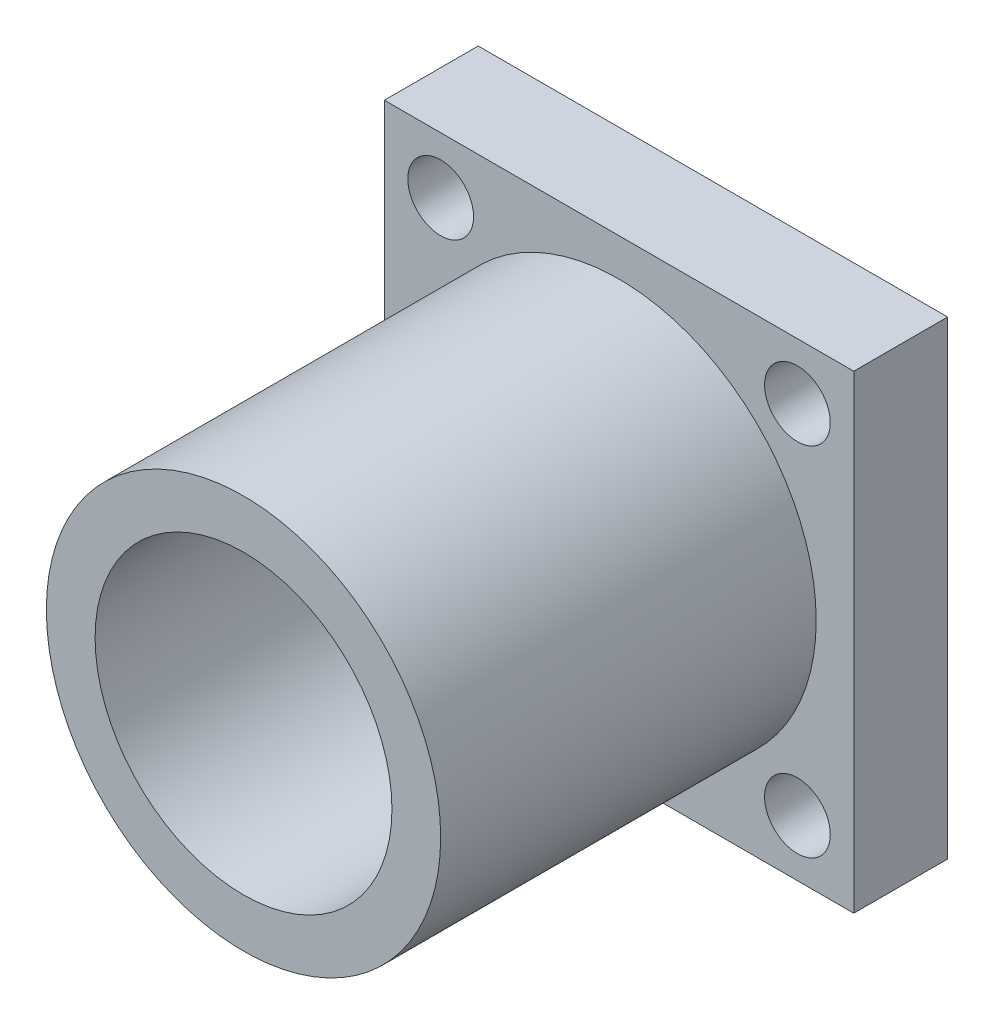
ISO-10303-21;
HEADER;
FILE_DESCRIPTION(('STEP AP214'),'2;1');
FILE_NAME('part.step','',(''),(''),'','','');
FILE_SCHEMA(('AUTOMOTIVE_DESIGN { 1 0 10303 214 1 1 1 1 }'));
ENDSEC;
DATA;
#1=APPLICATION_CONTEXT('core data for automotive mechanical design processes');
#2=APPLICATION_PROTOCOL_DEFINITION('international standard','automotive_design',2000,#1);
#3=PRODUCT_CONTEXT('',#1,'mechanical');
#4=PRODUCT('Part','Part','',(#3));
#5=PRODUCT_RELATED_PRODUCT_CATEGORY('part','',(#4));
#6=PRODUCT_DEFINITION_FORMATION('','',#4);
#7=PRODUCT_DEFINITION_CONTEXT('part definition',#1,'design');
#8=PRODUCT_DEFINITION('design','',#6,#7);
#9=PRODUCT_DEFINITION_SHAPE('','',#8);
#10=(LENGTH_UNIT() NAMED_UNIT(*) SI_UNIT(.MILLI.,.METRE.));
#11=(NAMED_UNIT(*) PLANE_ANGLE_UNIT() SI_UNIT($,.RADIAN.));
#12=(NAMED_UNIT(*) SI_UNIT($,.STERADIAN.) SOLID_ANGLE_UNIT());
#13=UNCERTAINTY_MEASURE_WITH_UNIT(LENGTH_MEASURE(1.E-05),#10,'distance_accuracy_value','');
#14=(GEOMETRIC_REPRESENTATION_CONTEXT(3) GLOBAL_UNCERTAINTY_ASSIGNED_CONTEXT((#13)) GLOBAL_UNIT_ASSIGNED_CONTEXT((#10,
#11,#12)) REPRESENTATION_CONTEXT('',''));
#15=CARTESIAN_POINT('',(0.,0.,0.));
#16=DIRECTION('',(0.,0.,1.));
#17=DIRECTION('',(1.,0.,0.));
#18=AXIS2_PLACEMENT_3D('',#15,#16,#17);
#19=CARTESIAN_POINT('',(0.,0.,5.));
#20=DIRECTION('',(0.,0.,1.));
#21=DIRECTION('',(1.,0.,0.));
#22=AXIS2_PLACEMENT_3D('',#19,#20,#21);
#23=PLANE('',#22);
#24=CARTESIAN_POINT('',(9.5,9.5,5.));
#25=DIRECTION('',(0.,0.,1.));
#26=DIRECTION('',(-1.,0.,0.));
#27=AXIS2_PLACEMENT_3D('',#24,#25,#26);
#28=CIRCLE('',#27,1.75);
#29=CARTESIAN_POINT('',(7.75,9.5,5.));
#30=VERTEX_POINT('',#29);
#31=EDGE_CURVE('E128',#30,#30,#28,.T.);
#32=ORIENTED_EDGE('',*,*,#31,.F.);
#33=EDGE_LOOP('',(#32));
#34=FACE_BOUND('',#33,.T.);
#35=CARTESIAN_POINT('',(-9.5,-9.5,5.));
#36=DIRECTION('',(0.,0.,1.));
#37=DIRECTION('',(-1.,0.,0.));
#38=AXIS2_PLACEMENT_3D('',#35,#36,#37);
#39=CIRCLE('',#38,1.75);
#40=CARTESIAN_POINT('',(-11.25,-9.5,5.));
#41=VERTEX_POINT('',#40);
#42=EDGE_CURVE('E116',#41,#41,#39,.T.);
#43=ORIENTED_EDGE('',*,*,#42,.F.);
#44=EDGE_LOOP('',(#43));
#45=FACE_BOUND('',#44,.T.);
#46=DIRECTION('',(0.,-1.,0.));
#47=VECTOR('',#46,1.);
#48=CARTESIAN_POINT('',(-12.5,-12.5,5.));
#49=LINE('',#48,#47);
#50=CARTESIAN_POINT('',(-12.5,12.5,5.));
#51=VERTEX_POINT('',#50);
#52=CARTESIAN_POINT('',(-12.5,-12.5,5.));
#53=VERTEX_POINT('',#52);
#54=EDGE_CURVE('E86',#51,#53,#49,.T.);
#55=ORIENTED_EDGE('',*,*,#54,.T.);
#56=DIRECTION('',(1.,0.,0.));
#57=VECTOR('',#56,1.);
#58=CARTESIAN_POINT('',(12.5,-12.5,5.));
#59=LINE('',#58,#57);
#60=CARTESIAN_POINT('',(12.5,-12.5,5.));
#61=VERTEX_POINT('',#60);
#62=EDGE_CURVE('E81',#53,#61,#59,.T.);
#63=ORIENTED_EDGE('',*,*,#62,.T.);
#64=DIRECTION('',(0.,1.,0.));
#65=VECTOR('',#64,1.);
#66=CARTESIAN_POINT('',(12.5,-12.5,5.));
#67=LINE('',#66,#65);
#68=CARTESIAN_POINT('',(12.5,12.5,5.));
#69=VERTEX_POINT('',#68);
#70=EDGE_CURVE('E84',#61,#69,#67,.T.);
#71=ORIENTED_EDGE('',*,*,#70,.T.);
#72=DIRECTION('',(-1.,0.,0.));
#73=VECTOR('',#72,1.);
#74=CARTESIAN_POINT('',(12.5,12.5,5.));
#75=LINE('',#74,#73);
#76=EDGE_CURVE('E51',#69,#51,#75,.T.);
#77=ORIENTED_EDGE('',*,*,#76,.T.);
#78=EDGE_LOOP('',(#55,#63,#71,#77));
#79=FACE_BOUND('',#78,.T.);
#80=CARTESIAN_POINT('',(-9.5,9.5,5.));
#81=DIRECTION('',(0.,0.,1.));
#82=DIRECTION('',(1.,0.,0.));
#83=AXIS2_PLACEMENT_3D('',#80,#81,#82);
#84=CIRCLE('',#83,1.75);
#85=CARTESIAN_POINT('',(-7.75,9.5,5.));
#86=VERTEX_POINT('',#85);
#87=EDGE_CURVE('E101',#86,#86,#84,.T.);
#88=ORIENTED_EDGE('',*,*,#87,.F.);
#89=EDGE_LOOP('',(#88));
#90=FACE_BOUND('',#89,.T.);
#91=CARTESIAN_POINT('',(9.50000000000001,-9.5,5.));
#92=DIRECTION('',(0.,0.,1.));
#93=DIRECTION('',(1.,0.,0.));
#94=AXIS2_PLACEMENT_3D('',#91,#92,#93);
#95=CIRCLE('',#94,1.75);
#96=CARTESIAN_POINT('',(11.25,-9.5,5.));
#97=VERTEX_POINT('',#96);
#98=EDGE_CURVE('E122',#97,#97,#95,.T.);
#99=ORIENTED_EDGE('',*,*,#98,.F.);
#100=EDGE_LOOP('',(#99));
#101=FACE_BOUND('',#100,.T.);
#102=CARTESIAN_POINT('',(0.,0.,5.));
#103=DIRECTION('',(0.,0.,1.));
#104=DIRECTION('',(1.,0.,0.));
#105=AXIS2_PLACEMENT_3D('',#102,#103,#104);
#106=CIRCLE('',#105,10.5);
#107=CARTESIAN_POINT('',(10.5,0.,5.));
#108=VERTEX_POINT('',#107);
#109=EDGE_CURVE('E140',#108,#108,#106,.T.);
#110=ORIENTED_EDGE('',*,*,#109,.F.);
#111=EDGE_LOOP('',(#110));
#112=FACE_BOUND('',#111,.T.);
#113=ADVANCED_FACE('F34',(#34,#45,#79,#90,#101,#112),#23,.T.);
#114=CARTESIAN_POINT('',(0.,0.,0.));
#115=DIRECTION('',(0.,0.,1.));
#116=DIRECTION('',(1.,0.,0.));
#117=AXIS2_PLACEMENT_3D('',#114,#115,#116);
#118=PLANE('',#117);
#119=CARTESIAN_POINT('',(0.,0.,0.));
#120=DIRECTION('',(0.,0.,1.));
#121=DIRECTION('',(1.,0.,0.));
#122=AXIS2_PLACEMENT_3D('',#119,#120,#121);
#123=CIRCLE('',#122,7.905);
#124=CARTESIAN_POINT('',(7.905,0.,0.));
#125=VERTEX_POINT('',#124);
#126=EDGE_CURVE('E134',#125,#125,#123,.T.);
#127=ORIENTED_EDGE('',*,*,#126,.T.);
#128=EDGE_LOOP('',(#127));
#129=FACE_BOUND('',#128,.T.);
#130=DIRECTION('',(0.,-1.,0.));
#131=VECTOR('',#130,1.);
#132=CARTESIAN_POINT('',(-12.5,-12.5,0.));
#133=LINE('',#132,#131);
#134=CARTESIAN_POINT('',(-12.5,12.5,0.));
#135=VERTEX_POINT('',#134);
#136=CARTESIAN_POINT('',(-12.5,-12.5,0.));
#137=VERTEX_POINT('',#136);
#138=EDGE_CURVE('E98',#135,#137,#133,.T.);
#139=ORIENTED_EDGE('',*,*,#138,.F.);
#140=DIRECTION('',(-1.,0.,0.));
#141=VECTOR('',#140,1.);
#142=CARTESIAN_POINT('',(12.5,12.5,0.));
#143=LINE('',#142,#141);
#144=CARTESIAN_POINT('',(12.5,12.5,0.));
#145=VERTEX_POINT('',#144);
#146=EDGE_CURVE('E74',#145,#135,#143,.T.);
#147=ORIENTED_EDGE('',*,*,#146,.F.);
#148=DIRECTION('',(0.,1.,0.));
#149=VECTOR('',#148,1.);
#150=CARTESIAN_POINT('',(12.5,-12.5,0.));
#151=LINE('',#150,#149);
#152=CARTESIAN_POINT('',(12.5,-12.5,0.));
#153=VERTEX_POINT('',#152);
#154=EDGE_CURVE('E68',#153,#145,#151,.T.);
#155=ORIENTED_EDGE('',*,*,#154,.F.);
#156=DIRECTION('',(1.,0.,0.));
#157=VECTOR('',#156,1.);
#158=CARTESIAN_POINT('',(12.5,-12.5,0.));
#159=LINE('',#158,#157);
#160=EDGE_CURVE('E90',#137,#153,#159,.T.);
#161=ORIENTED_EDGE('',*,*,#160,.F.);
#162=EDGE_LOOP('',(#139,#147,#155,#161));
#163=FACE_BOUND('',#162,.T.);
#164=CARTESIAN_POINT('',(-9.5,9.5,0.));
#165=DIRECTION('',(0.,0.,1.));
#166=DIRECTION('',(1.,0.,0.));
#167=AXIS2_PLACEMENT_3D('',#164,#165,#166);
#168=CIRCLE('',#167,1.75);
#169=CARTESIAN_POINT('',(-7.75,9.5,0.));
#170=VERTEX_POINT('',#169);
#171=EDGE_CURVE('E113',#170,#170,#168,.T.);
#172=ORIENTED_EDGE('',*,*,#171,.T.);
#173=EDGE_LOOP('',(#172));
#174=FACE_BOUND('',#173,.T.);
#175=CARTESIAN_POINT('',(-9.5,-9.5,0.));
#176=DIRECTION('',(0.,0.,1.));
#177=DIRECTION('',(-1.,0.,0.));
#178=AXIS2_PLACEMENT_3D('',#175,#176,#177);
#179=CIRCLE('',#178,1.75);
#180=CARTESIAN_POINT('',(-11.25,-9.5,0.));
#181=VERTEX_POINT('',#180);
#182=EDGE_CURVE('E119',#181,#181,#179,.T.);
#183=ORIENTED_EDGE('',*,*,#182,.T.);
#184=EDGE_LOOP('',(#183));
#185=FACE_BOUND('',#184,.T.);
#186=CARTESIAN_POINT('',(9.50000000000001,-9.5,0.));
#187=DIRECTION('',(0.,0.,1.));
#188=DIRECTION('',(1.,0.,0.));
#189=AXIS2_PLACEMENT_3D('',#186,#187,#188);
#190=CIRCLE('',#189,1.75);
#191=CARTESIAN_POINT('',(11.25,-9.5,0.));
#192=VERTEX_POINT('',#191);
#193=EDGE_CURVE('E125',#192,#192,#190,.T.);
#194=ORIENTED_EDGE('',*,*,#193,.T.);
#195=EDGE_LOOP('',(#194));
#196=FACE_BOUND('',#195,.T.);
#197=CARTESIAN_POINT('',(9.5,9.5,0.));
#198=DIRECTION('',(0.,0.,1.));
#199=DIRECTION('',(-1.,0.,0.));
#200=AXIS2_PLACEMENT_3D('',#197,#198,#199);
#201=CIRCLE('',#200,1.75);
#202=CARTESIAN_POINT('',(7.75,9.5,0.));
#203=VERTEX_POINT('',#202);
#204=EDGE_CURVE('E131',#203,#203,#201,.T.);
#205=ORIENTED_EDGE('',*,*,#204,.T.);
#206=EDGE_LOOP('',(#205));
#207=FACE_BOUND('',#206,.T.);
#208=ADVANCED_FACE('F109',(#129,#163,#174,#185,#196,#207),#118,.F.);
#209=CARTESIAN_POINT('',(-12.5,-12.5,5.));
#210=DIRECTION('',(1.,0.,0.));
#211=DIRECTION('',(0.,0.,-1.));
#212=AXIS2_PLACEMENT_3D('',#209,#210,#211);
#213=PLANE('',#212);
#214=ORIENTED_EDGE('',*,*,#138,.T.);
#215=DIRECTION('',(0.,0.,-1.));
#216=VECTOR('',#215,1.);
#217=CARTESIAN_POINT('',(-12.5,-12.5,5.));
#218=LINE('',#217,#216);
#219=EDGE_CURVE('E11',#53,#137,#218,.T.);
#220=ORIENTED_EDGE('',*,*,#219,.F.);
#221=ORIENTED_EDGE('',*,*,#54,.F.);
#222=DIRECTION('',(0.,0.,-1.));
#223=VECTOR('',#222,1.);
#224=CARTESIAN_POINT('',(-12.5,12.5,5.));
#225=LINE('',#224,#223);
#226=EDGE_CURVE('E94',#51,#135,#225,.T.);
#227=ORIENTED_EDGE('',*,*,#226,.T.);
#228=EDGE_LOOP('',(#214,#220,#221,#227));
#229=FACE_BOUND('',#228,.T.);
#230=ADVANCED_FACE('F36',(#229),#213,.F.);
#231=CARTESIAN_POINT('',(12.5,-12.5,5.));
#232=DIRECTION('',(0.,1.,0.));
#233=DIRECTION('',(0.,0.,1.));
#234=AXIS2_PLACEMENT_3D('',#231,#232,#233);
#235=PLANE('',#234);
#236=ORIENTED_EDGE('',*,*,#160,.T.);
#237=DIRECTION('',(0.,0.,-1.));
#238=VECTOR('',#237,1.);
#239=CARTESIAN_POINT('',(12.5,-12.5,5.));
#240=LINE('',#239,#238);
#241=EDGE_CURVE('E43',#61,#153,#240,.T.);
#242=ORIENTED_EDGE('',*,*,#241,.F.);
#243=ORIENTED_EDGE('',*,*,#62,.F.);
#244=ORIENTED_EDGE('',*,*,#219,.T.);
#245=EDGE_LOOP('',(#236,#242,#243,#244));
#246=FACE_BOUND('',#245,.T.);
#247=ADVANCED_FACE('F89',(#246),#235,.F.);
#248=CARTESIAN_POINT('',(12.5,-12.5,5.));
#249=DIRECTION('',(-1.,0.,0.));
#250=DIRECTION('',(0.,0.,1.));
#251=AXIS2_PLACEMENT_3D('',#248,#249,#250);
#252=PLANE('',#251);
#253=ORIENTED_EDGE('',*,*,#154,.T.);
#254=DIRECTION('',(0.,0.,-1.));
#255=VECTOR('',#254,1.);
#256=CARTESIAN_POINT('',(12.5,12.5,5.));
#257=LINE('',#256,#255);
#258=EDGE_CURVE('E91',#69,#145,#257,.T.);
#259=ORIENTED_EDGE('',*,*,#258,.F.);
#260=ORIENTED_EDGE('',*,*,#70,.F.);
#261=ORIENTED_EDGE('',*,*,#241,.T.);
#262=EDGE_LOOP('',(#253,#259,#260,#261));
#263=FACE_BOUND('',#262,.T.);
#264=ADVANCED_FACE('F92',(#263),#252,.F.);
#265=CARTESIAN_POINT('',(12.5,12.5,5.));
#266=DIRECTION('',(0.,-1.,0.));
#267=DIRECTION('',(0.,0.,-1.));
#268=AXIS2_PLACEMENT_3D('',#265,#266,#267);
#269=PLANE('',#268);
#270=ORIENTED_EDGE('',*,*,#146,.T.);
#271=ORIENTED_EDGE('',*,*,#226,.F.);
#272=ORIENTED_EDGE('',*,*,#76,.F.);
#273=ORIENTED_EDGE('',*,*,#258,.T.);
#274=EDGE_LOOP('',(#270,#271,#272,#273));
#275=FACE_BOUND('',#274,.T.);
#276=ADVANCED_FACE('F106',(#275),#269,.F.);
#277=CARTESIAN_POINT('',(-9.5,9.5,5.));
#278=DIRECTION('',(0.,0.,-1.));
#279=DIRECTION('',(-1.,0.,0.));
#280=AXIS2_PLACEMENT_3D('',#277,#278,#279);
#281=CYLINDRICAL_SURFACE('',#280,1.75);
#282=ORIENTED_EDGE('',*,*,#87,.T.);
#283=EDGE_LOOP('',(#282));
#284=FACE_BOUND('',#283,.T.);
#285=ORIENTED_EDGE('',*,*,#171,.F.);
#286=EDGE_LOOP('',(#285));
#287=FACE_BOUND('',#286,.T.);
#288=ADVANCED_FACE('F176',(#284,#287),#281,.F.);
#289=CARTESIAN_POINT('',(-9.5,-9.5,5.));
#290=DIRECTION('',(0.,0.,-1.));
#291=DIRECTION('',(-1.,0.,0.));
#292=AXIS2_PLACEMENT_3D('',#289,#290,#291);
#293=CYLINDRICAL_SURFACE('',#292,1.75);
#294=ORIENTED_EDGE('',*,*,#42,.T.);
#295=EDGE_LOOP('',(#294));
#296=FACE_BOUND('',#295,.T.);
#297=ORIENTED_EDGE('',*,*,#182,.F.);
#298=EDGE_LOOP('',(#297));
#299=FACE_BOUND('',#298,.T.);
#300=ADVANCED_FACE('F229',(#296,#299),#293,.F.);
#301=CARTESIAN_POINT('',(9.50000000000001,-9.5,5.));
#302=DIRECTION('',(0.,0.,-1.));
#303=DIRECTION('',(-1.,0.,0.));
#304=AXIS2_PLACEMENT_3D('',#301,#302,#303);
#305=CYLINDRICAL_SURFACE('',#304,1.75);
#306=ORIENTED_EDGE('',*,*,#98,.T.);
#307=EDGE_LOOP('',(#306));
#308=FACE_BOUND('',#307,.T.);
#309=ORIENTED_EDGE('',*,*,#193,.F.);
#310=EDGE_LOOP('',(#309));
#311=FACE_BOUND('',#310,.T.);
#312=ADVANCED_FACE('F224',(#308,#311),#305,.F.);
#313=CARTESIAN_POINT('',(9.5,9.5,5.));
#314=DIRECTION('',(0.,0.,-1.));
#315=DIRECTION('',(-1.,0.,0.));
#316=AXIS2_PLACEMENT_3D('',#313,#314,#315);
#317=CYLINDRICAL_SURFACE('',#316,1.75);
#318=ORIENTED_EDGE('',*,*,#31,.T.);
#319=EDGE_LOOP('',(#318));
#320=FACE_BOUND('',#319,.T.);
#321=ORIENTED_EDGE('',*,*,#204,.F.);
#322=EDGE_LOOP('',(#321));
#323=FACE_BOUND('',#322,.T.);
#324=ADVANCED_FACE('F162',(#320,#323),#317,.F.);
#325=CARTESIAN_POINT('',(0.,0.,0.));
#326=DIRECTION('',(0.,0.,1.));
#327=DIRECTION('',(1.,0.,0.));
#328=AXIS2_PLACEMENT_3D('',#325,#326,#327);
#329=CYLINDRICAL_SURFACE('',#328,7.905);
#330=ORIENTED_EDGE('',*,*,#126,.F.);
#331=EDGE_LOOP('',(#330));
#332=FACE_BOUND('',#331,.T.);
#333=CARTESIAN_POINT('',(0.,0.,25.));
#334=DIRECTION('',(0.,0.,1.));
#335=DIRECTION('',(1.,0.,0.));
#336=AXIS2_PLACEMENT_3D('',#333,#334,#335);
#337=CIRCLE('',#336,7.905);
#338=CARTESIAN_POINT('',(7.905,0.,25.));
#339=VERTEX_POINT('',#338);
#340=EDGE_CURVE('E143',#339,#339,#337,.T.);
#341=ORIENTED_EDGE('',*,*,#340,.T.);
#342=EDGE_LOOP('',(#341));
#343=FACE_BOUND('',#342,.T.);
#344=ADVANCED_FACE('F149',(#332,#343),#329,.F.);
#345=CARTESIAN_POINT('',(0.,0.,25.));
#346=DIRECTION('',(0.,0.,1.));
#347=DIRECTION('',(1.,0.,0.));
#348=AXIS2_PLACEMENT_3D('',#345,#346,#347);
#349=PLANE('',#348);
#350=CARTESIAN_POINT('',(0.,0.,25.));
#351=DIRECTION('',(0.,0.,1.));
#352=DIRECTION('',(1.,0.,0.));
#353=AXIS2_PLACEMENT_3D('',#350,#351,#352);
#354=CIRCLE('',#353,10.5);
#355=CARTESIAN_POINT('',(10.5,0.,25.));
#356=VERTEX_POINT('',#355);
#357=EDGE_CURVE('E139',#356,#356,#354,.T.);
#358=ORIENTED_EDGE('',*,*,#357,.T.);
#359=EDGE_LOOP('',(#358));
#360=FACE_BOUND('',#359,.T.);
#361=ORIENTED_EDGE('',*,*,#340,.F.);
#362=EDGE_LOOP('',(#361));
#363=FACE_BOUND('',#362,.T.);
#364=ADVANCED_FACE('F151',(#360,#363),#349,.T.);
#365=CARTESIAN_POINT('',(0.,0.,25.));
#366=DIRECTION('',(0.,0.,-1.));
#367=DIRECTION('',(-1.,0.,0.));
#368=AXIS2_PLACEMENT_3D('',#365,#366,#367);
#369=CYLINDRICAL_SURFACE('',#368,10.5);
#370=ORIENTED_EDGE('',*,*,#357,.F.);
#371=EDGE_LOOP('',(#370));
#372=FACE_BOUND('',#371,.T.);
#373=ORIENTED_EDGE('',*,*,#109,.T.);
#374=EDGE_LOOP('',(#373));
#375=FACE_BOUND('',#374,.T.);
#376=ADVANCED_FACE('F153',(#372,#375),#369,.T.);
#377=CLOSED_SHELL('',(#113,#208,#230,#247,#264,#276,#288,#300,#312,#324,#344,#364,#376));
#378=MANIFOLD_SOLID_BREP('B2',#377);
#379=ADVANCED_BREP_SHAPE_REPRESENTATION('',(#18,#378),#14);
#380=SHAPE_DEFINITION_REPRESENTATION(#9,#379);
ENDSEC;
END-ISO-10303-21;
